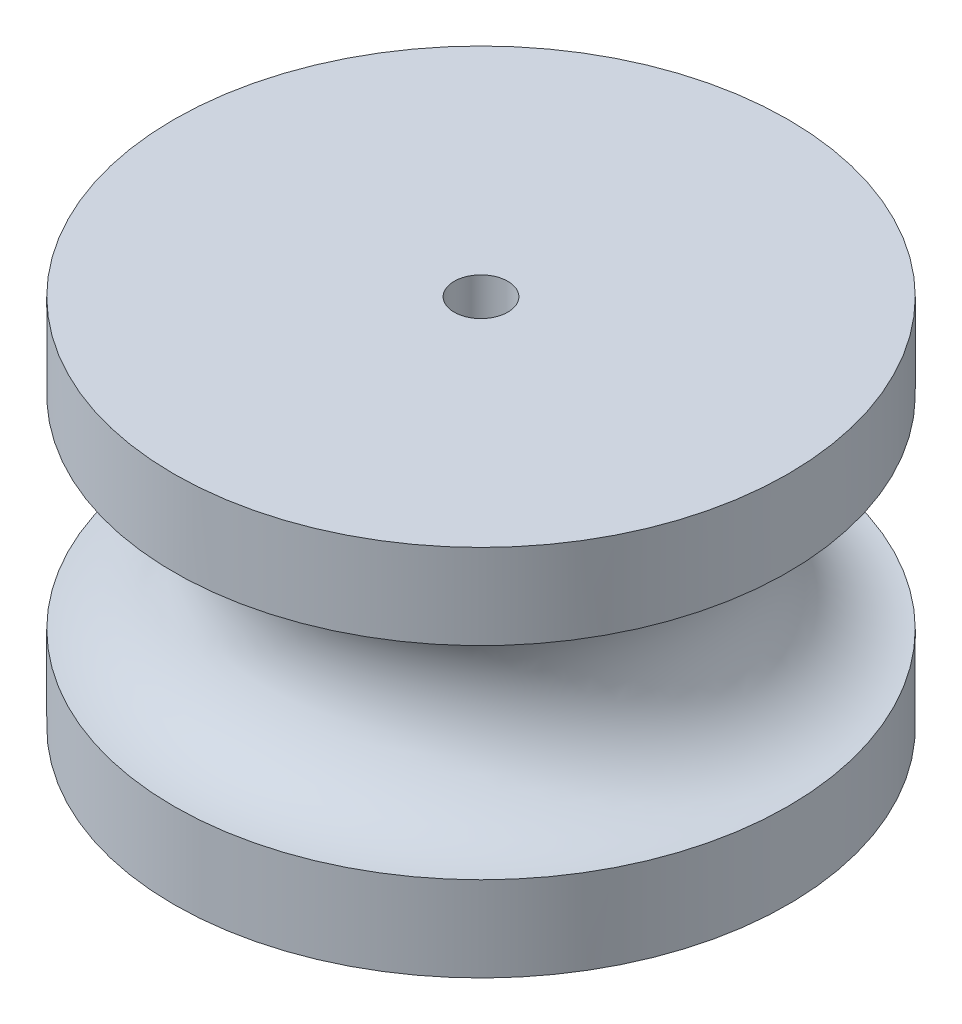
ISO-10303-21;
HEADER;
FILE_DESCRIPTION(('STEP AP214'),'2;1');
FILE_NAME('part.step','',(''),(''),'','','');
FILE_SCHEMA(('AUTOMOTIVE_DESIGN { 1 0 10303 214 1 1 1 1 }'));
ENDSEC;
DATA;
#1=APPLICATION_CONTEXT('core data for automotive mechanical design processes');
#2=APPLICATION_PROTOCOL_DEFINITION('international standard','automotive_design',2000,#1);
#3=PRODUCT_CONTEXT('',#1,'mechanical');
#4=PRODUCT('Part','Part','',(#3));
#5=PRODUCT_RELATED_PRODUCT_CATEGORY('part','',(#4));
#6=PRODUCT_DEFINITION_FORMATION('','',#4);
#7=PRODUCT_DEFINITION_CONTEXT('part definition',#1,'design');
#8=PRODUCT_DEFINITION('design','',#6,#7);
#9=PRODUCT_DEFINITION_SHAPE('','',#8);
#10=(LENGTH_UNIT() NAMED_UNIT(*) SI_UNIT(.MILLI.,.METRE.));
#11=(NAMED_UNIT(*) PLANE_ANGLE_UNIT() SI_UNIT($,.RADIAN.));
#12=(NAMED_UNIT(*) SI_UNIT($,.STERADIAN.) SOLID_ANGLE_UNIT());
#13=UNCERTAINTY_MEASURE_WITH_UNIT(LENGTH_MEASURE(1.E-05),#10,'distance_accuracy_value','');
#14=(GEOMETRIC_REPRESENTATION_CONTEXT(3) GLOBAL_UNCERTAINTY_ASSIGNED_CONTEXT((#13)) GLOBAL_UNIT_ASSIGNED_CONTEXT((#10,
#11,#12)) REPRESENTATION_CONTEXT('',''));
#15=CARTESIAN_POINT('',(0.,0.,0.));
#16=DIRECTION('',(0.,0.,1.));
#17=DIRECTION('',(1.,0.,0.));
#18=AXIS2_PLACEMENT_3D('',#15,#16,#17);
#19=CARTESIAN_POINT('',(0.,6.5,0.));
#20=DIRECTION('',(0.,-1.,0.));
#21=DIRECTION('',(0.,0.,-1.));
#22=AXIS2_PLACEMENT_3D('',#19,#20,#21);
#23=CYLINDRICAL_SURFACE('',#22,7.);
#24=CARTESIAN_POINT('',(0.,0.,0.));
#25=DIRECTION('',(0.,1.,0.));
#26=DIRECTION('',(0.,0.,1.));
#27=AXIS2_PLACEMENT_3D('',#24,#25,#26);
#28=CIRCLE('',#27,7.);
#29=CARTESIAN_POINT('',(0.,0.,7.));
#30=VERTEX_POINT('',#29);
#31=EDGE_CURVE('E11',#30,#30,#28,.T.);
#32=ORIENTED_EDGE('',*,*,#31,.T.);
#33=EDGE_LOOP('',(#32));
#34=FACE_BOUND('',#33,.T.);
#35=CARTESIAN_POINT('',(0.,1.93902957173384,0.));
#36=DIRECTION('',(0.,1.,0.));
#37=DIRECTION('',(0.,0.,1.));
#38=AXIS2_PLACEMENT_3D('',#35,#36,#37);
#39=CIRCLE('',#38,7.);
#40=CARTESIAN_POINT('',(0.,1.93902957173384,7.));
#41=VERTEX_POINT('',#40);
#42=EDGE_CURVE('E42',#41,#41,#39,.T.);
#43=ORIENTED_EDGE('',*,*,#42,.F.);
#44=EDGE_LOOP('',(#43));
#45=FACE_BOUND('',#44,.T.);
#46=ADVANCED_FACE('F39',(#34,#45),#23,.T.);
#47=CARTESIAN_POINT('',(0.,8.5,0.));
#48=DIRECTION('',(0.,1.,0.));
#49=DIRECTION('',(0.,0.,1.));
#50=AXIS2_PLACEMENT_3D('',#47,#48,#49);
#51=CIRCLE('',#50,7.);
#52=CARTESIAN_POINT('',(0.,8.5,7.));
#53=VERTEX_POINT('',#52);
#54=EDGE_CURVE('E130',#53,#53,#51,.T.);
#55=ORIENTED_EDGE('',*,*,#54,.F.);
#56=EDGE_LOOP('',(#55));
#57=FACE_BOUND('',#56,.T.);
#58=CARTESIAN_POINT('',(0.,6.56097042826617,0.));
#59=DIRECTION('',(0.,-1.,0.));
#60=DIRECTION('',(0.,0.,-1.));
#61=AXIS2_PLACEMENT_3D('',#58,#59,#60);
#62=CIRCLE('',#61,7.);
#63=CARTESIAN_POINT('',(0.,6.56097042826617,-7.));
#64=VERTEX_POINT('',#63);
#65=EDGE_CURVE('E112',#64,#64,#62,.T.);
#66=ORIENTED_EDGE('',*,*,#65,.F.);
#67=EDGE_LOOP('',(#66));
#68=FACE_BOUND('',#67,.T.);
#69=ADVANCED_FACE('F164',(#57,#68),#23,.T.);
#70=CARTESIAN_POINT('',(0.,0.,0.));
#71=DIRECTION('',(0.,1.,0.));
#72=DIRECTION('',(0.,0.,1.));
#73=AXIS2_PLACEMENT_3D('',#70,#71,#72);
#74=PLANE('',#73);
#75=ORIENTED_EDGE('',*,*,#31,.F.);
#76=EDGE_LOOP('',(#75));
#77=FACE_BOUND('',#76,.T.);
#78=CARTESIAN_POINT('',(0.,0.,0.));
#79=DIRECTION('',(0.,1.,0.));
#80=DIRECTION('',(0.,0.,1.));
#81=AXIS2_PLACEMENT_3D('',#78,#79,#80);
#82=CIRCLE('',#81,2.7);
#83=CARTESIAN_POINT('',(-1.88,0.,1.93793704748116));
#84=VERTEX_POINT('',#83);
#85=CARTESIAN_POINT('',(1.88,0.,1.93793704748116));
#86=VERTEX_POINT('',#85);
#87=EDGE_CURVE('E64',#84,#86,#82,.T.);
#88=ORIENTED_EDGE('',*,*,#87,.T.);
#89=DIRECTION('',(0.,0.,-1.));
#90=VECTOR('',#89,1.);
#91=CARTESIAN_POINT('',(1.88,0.,-1.93793704748116));
#92=LINE('',#91,#90);
#93=CARTESIAN_POINT('',(1.88,0.,-1.93793704748116));
#94=VERTEX_POINT('',#93);
#95=EDGE_CURVE('E143',#86,#94,#92,.T.);
#96=ORIENTED_EDGE('',*,*,#95,.T.);
#97=CARTESIAN_POINT('',(0.,0.,0.));
#98=DIRECTION('',(0.,1.,0.));
#99=DIRECTION('',(0.,0.,1.));
#100=AXIS2_PLACEMENT_3D('',#97,#98,#99);
#101=CIRCLE('',#100,2.7);
#102=CARTESIAN_POINT('',(-1.88,0.,-1.93793704748116));
#103=VERTEX_POINT('',#102);
#104=EDGE_CURVE('E101',#94,#103,#101,.T.);
#105=ORIENTED_EDGE('',*,*,#104,.T.);
#106=DIRECTION('',(0.,0.,1.));
#107=VECTOR('',#106,1.);
#108=CARTESIAN_POINT('',(-1.88,0.,-1.93793704748116));
#109=LINE('',#108,#107);
#110=EDGE_CURVE('E137',#103,#84,#109,.T.);
#111=ORIENTED_EDGE('',*,*,#110,.T.);
#112=EDGE_LOOP('',(#88,#96,#105,#111));
#113=FACE_BOUND('',#112,.T.);
#114=ADVANCED_FACE('F155',(#77,#113),#74,.F.);
#115=CARTESIAN_POINT('',(0.,6.5,0.));
#116=DIRECTION('',(0.,-1.,0.));
#117=DIRECTION('',(0.,0.,-1.));
#118=AXIS2_PLACEMENT_3D('',#115,#116,#117);
#119=CYLINDRICAL_SURFACE('',#118,2.7);
#120=ORIENTED_EDGE('',*,*,#87,.F.);
#121=DIRECTION('',(0.,-1.,0.));
#122=VECTOR('',#121,1.);
#123=CARTESIAN_POINT('',(-1.88,6.5,1.93793704748116));
#124=LINE('',#123,#122);
#125=CARTESIAN_POINT('',(-1.88,6.5,1.93793704748116));
#126=VERTEX_POINT('',#125);
#127=EDGE_CURVE('E109',#126,#84,#124,.T.);
#128=ORIENTED_EDGE('',*,*,#127,.F.);
#129=CARTESIAN_POINT('',(0.,6.5,0.));
#130=DIRECTION('',(0.,1.,0.));
#131=DIRECTION('',(0.,0.,1.));
#132=AXIS2_PLACEMENT_3D('',#129,#130,#131);
#133=CIRCLE('',#132,2.7);
#134=CARTESIAN_POINT('',(1.88,6.5,1.93793704748116));
#135=VERTEX_POINT('',#134);
#136=EDGE_CURVE('E97',#126,#135,#133,.T.);
#137=ORIENTED_EDGE('',*,*,#136,.T.);
#138=DIRECTION('',(0.,-1.,0.));
#139=VECTOR('',#138,1.);
#140=CARTESIAN_POINT('',(1.88,6.5,1.93793704748116));
#141=LINE('',#140,#139);
#142=EDGE_CURVE('E48',#135,#86,#141,.T.);
#143=ORIENTED_EDGE('',*,*,#142,.T.);
#144=EDGE_LOOP('',(#120,#128,#137,#143));
#145=FACE_BOUND('',#144,.T.);
#146=ADVANCED_FACE('F156',(#145),#119,.F.);
#147=CARTESIAN_POINT('',(1.88,6.5,-1.93793704748116));
#148=DIRECTION('',(-1.,0.,0.));
#149=DIRECTION('',(0.,0.,1.));
#150=AXIS2_PLACEMENT_3D('',#147,#148,#149);
#151=PLANE('',#150);
#152=ORIENTED_EDGE('',*,*,#95,.F.);
#153=ORIENTED_EDGE('',*,*,#142,.F.);
#154=DIRECTION('',(0.,0.,-1.));
#155=VECTOR('',#154,1.);
#156=CARTESIAN_POINT('',(1.88,6.5,-1.93793704748116));
#157=LINE('',#156,#155);
#158=CARTESIAN_POINT('',(1.88,6.5,-1.93793704748116));
#159=VERTEX_POINT('',#158);
#160=EDGE_CURVE('E85',#135,#159,#157,.T.);
#161=ORIENTED_EDGE('',*,*,#160,.T.);
#162=DIRECTION('',(0.,-1.,0.));
#163=VECTOR('',#162,1.);
#164=CARTESIAN_POINT('',(1.88,6.5,-1.93793704748116));
#165=LINE('',#164,#163);
#166=EDGE_CURVE('E94',#159,#94,#165,.T.);
#167=ORIENTED_EDGE('',*,*,#166,.T.);
#168=EDGE_LOOP('',(#152,#153,#161,#167));
#169=FACE_BOUND('',#168,.T.);
#170=ADVANCED_FACE('F93',(#169),#151,.T.);
#171=CARTESIAN_POINT('',(0.,6.5,0.));
#172=DIRECTION('',(0.,-1.,0.));
#173=DIRECTION('',(0.,0.,-1.));
#174=AXIS2_PLACEMENT_3D('',#171,#172,#173);
#175=CYLINDRICAL_SURFACE('',#174,2.7);
#176=ORIENTED_EDGE('',*,*,#104,.F.);
#177=ORIENTED_EDGE('',*,*,#166,.F.);
#178=CARTESIAN_POINT('',(0.,6.5,0.));
#179=DIRECTION('',(0.,1.,0.));
#180=DIRECTION('',(0.,0.,1.));
#181=AXIS2_PLACEMENT_3D('',#178,#179,#180);
#182=CIRCLE('',#181,2.7);
#183=CARTESIAN_POINT('',(-1.88,6.5,-1.93793704748116));
#184=VERTEX_POINT('',#183);
#185=EDGE_CURVE('E82',#159,#184,#182,.T.);
#186=ORIENTED_EDGE('',*,*,#185,.T.);
#187=DIRECTION('',(0.,-1.,0.));
#188=VECTOR('',#187,1.);
#189=CARTESIAN_POINT('',(-1.88,6.5,-1.93793704748116));
#190=LINE('',#189,#188);
#191=EDGE_CURVE('E104',#184,#103,#190,.T.);
#192=ORIENTED_EDGE('',*,*,#191,.T.);
#193=EDGE_LOOP('',(#176,#177,#186,#192));
#194=FACE_BOUND('',#193,.T.);
#195=ADVANCED_FACE('F99',(#194),#175,.F.);
#196=CARTESIAN_POINT('',(-1.88,6.5,-1.93793704748116));
#197=DIRECTION('',(1.,0.,0.));
#198=DIRECTION('',(0.,0.,-1.));
#199=AXIS2_PLACEMENT_3D('',#196,#197,#198);
#200=PLANE('',#199);
#201=ORIENTED_EDGE('',*,*,#110,.F.);
#202=ORIENTED_EDGE('',*,*,#191,.F.);
#203=DIRECTION('',(0.,0.,1.));
#204=VECTOR('',#203,1.);
#205=CARTESIAN_POINT('',(-1.88,6.5,-1.93793704748116));
#206=LINE('',#205,#204);
#207=EDGE_CURVE('E56',#184,#126,#206,.T.);
#208=ORIENTED_EDGE('',*,*,#207,.T.);
#209=ORIENTED_EDGE('',*,*,#127,.T.);
#210=EDGE_LOOP('',(#201,#202,#208,#209));
#211=FACE_BOUND('',#210,.T.);
#212=ADVANCED_FACE('F153',(#211),#200,.T.);
#213=CARTESIAN_POINT('',(0.,6.5,0.));
#214=DIRECTION('',(0.,1.,0.));
#215=DIRECTION('',(0.,0.,1.));
#216=AXIS2_PLACEMENT_3D('',#213,#214,#215);
#217=PLANE('',#216);
#218=CARTESIAN_POINT('',(0.,6.5,0.));
#219=DIRECTION('',(0.,1.,0.));
#220=DIRECTION('',(0.,0.,1.));
#221=AXIS2_PLACEMENT_3D('',#218,#219,#220);
#222=CIRCLE('',#221,0.61119766593265);
#223=CARTESIAN_POINT('',(0.,6.5,0.61119766593265));
#224=VERTEX_POINT('',#223);
#225=EDGE_CURVE('E119',#224,#224,#222,.T.);
#226=ORIENTED_EDGE('',*,*,#225,.T.);
#227=EDGE_LOOP('',(#226));
#228=FACE_BOUND('',#227,.T.);
#229=ORIENTED_EDGE('',*,*,#160,.F.);
#230=ORIENTED_EDGE('',*,*,#136,.F.);
#231=ORIENTED_EDGE('',*,*,#207,.F.);
#232=ORIENTED_EDGE('',*,*,#185,.F.);
#233=EDGE_LOOP('',(#229,#230,#231,#232));
#234=FACE_BOUND('',#233,.T.);
#235=ADVANCED_FACE('F84',(#228,#234),#217,.F.);
#236=CARTESIAN_POINT('',(0.,8.5,0.));
#237=DIRECTION('',(0.,1.,0.));
#238=DIRECTION('',(0.,0.,1.));
#239=AXIS2_PLACEMENT_3D('',#236,#237,#238);
#240=PLANE('',#239);
#241=ORIENTED_EDGE('',*,*,#54,.T.);
#242=EDGE_LOOP('',(#241));
#243=FACE_BOUND('',#242,.T.);
#244=CARTESIAN_POINT('',(0.,8.5,0.));
#245=DIRECTION('',(0.,1.,0.));
#246=DIRECTION('',(0.,0.,1.));
#247=AXIS2_PLACEMENT_3D('',#244,#245,#246);
#248=CIRCLE('',#247,0.61119766593265);
#249=CARTESIAN_POINT('',(0.,8.5,0.61119766593265));
#250=VERTEX_POINT('',#249);
#251=EDGE_CURVE('E124',#250,#250,#248,.T.);
#252=ORIENTED_EDGE('',*,*,#251,.F.);
#253=EDGE_LOOP('',(#252));
#254=FACE_BOUND('',#253,.T.);
#255=ADVANCED_FACE('F179',(#243,#254),#240,.T.);
#256=CARTESIAN_POINT('',(0.,8.5,0.));
#257=DIRECTION('',(0.,-1.,0.));
#258=DIRECTION('',(0.,0.,-1.));
#259=AXIS2_PLACEMENT_3D('',#256,#257,#258);
#260=CYLINDRICAL_SURFACE('',#259,0.61119766593265);
#261=ORIENTED_EDGE('',*,*,#251,.T.);
#262=EDGE_LOOP('',(#261));
#263=FACE_BOUND('',#262,.T.);
#264=ORIENTED_EDGE('',*,*,#225,.F.);
#265=EDGE_LOOP('',(#264));
#266=FACE_BOUND('',#265,.T.);
#267=ADVANCED_FACE('F182',(#263,#266),#260,.F.);
#268=CARTESIAN_POINT('',(0.,4.25,0.));
#269=DIRECTION('',(0.,-1.,0.));
#270=DIRECTION('',(0.,0.,-1.));
#271=AXIS2_PLACEMENT_3D('',#268,#269,#270);
#272=TOROIDAL_SURFACE('',#271,7.,2.31097042826616);
#273=ORIENTED_EDGE('',*,*,#65,.T.);
#274=EDGE_LOOP('',(#273));
#275=FACE_BOUND('',#274,.T.);
#276=ORIENTED_EDGE('',*,*,#42,.T.);
#277=EDGE_LOOP('',(#276));
#278=FACE_BOUND('',#277,.T.);
#279=ADVANCED_FACE('F188',(#275,#278),#272,.F.);
#280=CLOSED_SHELL('',(#46,#69,#114,#146,#170,#195,#212,#235,#255,#267,#279));
#281=MANIFOLD_SOLID_BREP('B2',#280);
#282=ADVANCED_BREP_SHAPE_REPRESENTATION('',(#18,#281),#14);
#283=SHAPE_DEFINITION_REPRESENTATION(#9,#282);
ENDSEC;
END-ISO-10303-21;
